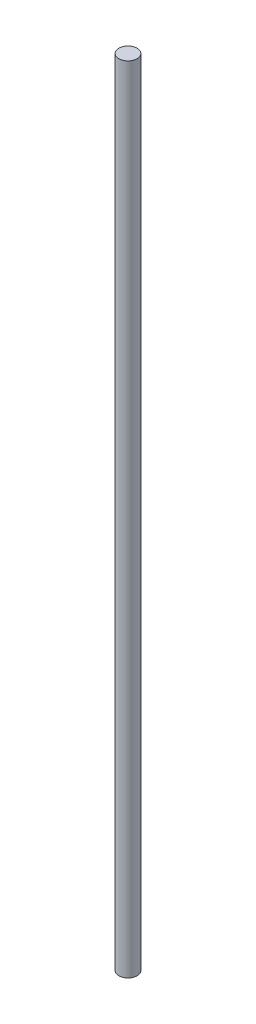
ISO-10303-21;
HEADER;
FILE_DESCRIPTION(('STEP AP214'),'2;1');
FILE_NAME('part.step','',(''),(''),'','','');
FILE_SCHEMA(('AUTOMOTIVE_DESIGN { 1 0 10303 214 1 1 1 1 }'));
ENDSEC;
DATA;
#1=APPLICATION_CONTEXT('core data for automotive mechanical design processes');
#2=APPLICATION_PROTOCOL_DEFINITION('international standard','automotive_design',2000,#1);
#3=PRODUCT_CONTEXT('',#1,'mechanical');
#4=PRODUCT('Part','Part','',(#3));
#5=PRODUCT_RELATED_PRODUCT_CATEGORY('part','',(#4));
#6=PRODUCT_DEFINITION_FORMATION('','',#4);
#7=PRODUCT_DEFINITION_CONTEXT('part definition',#1,'design');
#8=PRODUCT_DEFINITION('design','',#6,#7);
#9=PRODUCT_DEFINITION_SHAPE('','',#8);
#10=(LENGTH_UNIT() NAMED_UNIT(*) SI_UNIT(.MILLI.,.METRE.));
#11=(NAMED_UNIT(*) PLANE_ANGLE_UNIT() SI_UNIT($,.RADIAN.));
#12=(NAMED_UNIT(*) SI_UNIT($,.STERADIAN.) SOLID_ANGLE_UNIT());
#13=UNCERTAINTY_MEASURE_WITH_UNIT(LENGTH_MEASURE(1.E-05),#10,'distance_accuracy_value','');
#14=(GEOMETRIC_REPRESENTATION_CONTEXT(3) GLOBAL_UNCERTAINTY_ASSIGNED_CONTEXT((#13)) GLOBAL_UNIT_ASSIGNED_CONTEXT((#10,
#11,#12)) REPRESENTATION_CONTEXT('',''));
#15=CARTESIAN_POINT('',(0.,0.,0.));
#16=DIRECTION('',(0.,0.,1.));
#17=DIRECTION('',(1.,0.,0.));
#18=AXIS2_PLACEMENT_3D('',#15,#16,#17);
#19=CARTESIAN_POINT('',(0.,152.4,0.));
#20=DIRECTION('',(0.,-1.,0.));
#21=DIRECTION('',(0.,0.,-1.));
#22=AXIS2_PLACEMENT_3D('',#19,#20,#21);
#23=CYLINDRICAL_SURFACE('',#22,1.75);
#24=CARTESIAN_POINT('',(0.,152.4,0.));
#25=DIRECTION('',(0.,1.,0.));
#26=DIRECTION('',(0.,0.,1.));
#27=AXIS2_PLACEMENT_3D('',#24,#25,#26);
#28=CIRCLE('',#27,1.75);
#29=CARTESIAN_POINT('',(0.,152.4,1.75));
#30=VERTEX_POINT('',#29);
#31=EDGE_CURVE('E10',#30,#30,#28,.T.);
#32=ORIENTED_EDGE('',*,*,#31,.F.);
#33=EDGE_LOOP('',(#32));
#34=FACE_BOUND('',#33,.T.);
#35=CARTESIAN_POINT('',(0.,0.,0.));
#36=DIRECTION('',(0.,1.,0.));
#37=DIRECTION('',(0.,0.,1.));
#38=AXIS2_PLACEMENT_3D('',#35,#36,#37);
#39=CIRCLE('',#38,1.75);
#40=CARTESIAN_POINT('',(0.,0.,1.75));
#41=VERTEX_POINT('',#40);
#42=EDGE_CURVE('E46',#41,#41,#39,.T.);
#43=ORIENTED_EDGE('',*,*,#42,.T.);
#44=EDGE_LOOP('',(#43));
#45=FACE_BOUND('',#44,.T.);
#46=ADVANCED_FACE('F43',(#34,#45),#23,.T.);
#47=CARTESIAN_POINT('',(0.,152.4,0.));
#48=DIRECTION('',(0.,1.,0.));
#49=DIRECTION('',(0.,0.,1.));
#50=AXIS2_PLACEMENT_3D('',#47,#48,#49);
#51=PLANE('',#50);
#52=ORIENTED_EDGE('',*,*,#31,.T.);
#53=EDGE_LOOP('',(#52));
#54=FACE_BOUND('',#53,.T.);
#55=ADVANCED_FACE('F60',(#54),#51,.T.);
#56=CARTESIAN_POINT('',(0.,0.,0.));
#57=DIRECTION('',(0.,1.,0.));
#58=DIRECTION('',(0.,0.,1.));
#59=AXIS2_PLACEMENT_3D('',#56,#57,#58);
#60=PLANE('',#59);
#61=ORIENTED_EDGE('',*,*,#42,.F.);
#62=EDGE_LOOP('',(#61));
#63=FACE_BOUND('',#62,.T.);
#64=ADVANCED_FACE('F58',(#63),#60,.F.);
#65=CLOSED_SHELL('',(#46,#55,#64));
#66=MANIFOLD_SOLID_BREP('B2',#65);
#67=ADVANCED_BREP_SHAPE_REPRESENTATION('',(#18,#66),#14);
#68=SHAPE_DEFINITION_REPRESENTATION(#9,#67);
ENDSEC;
END-ISO-10303-21;
